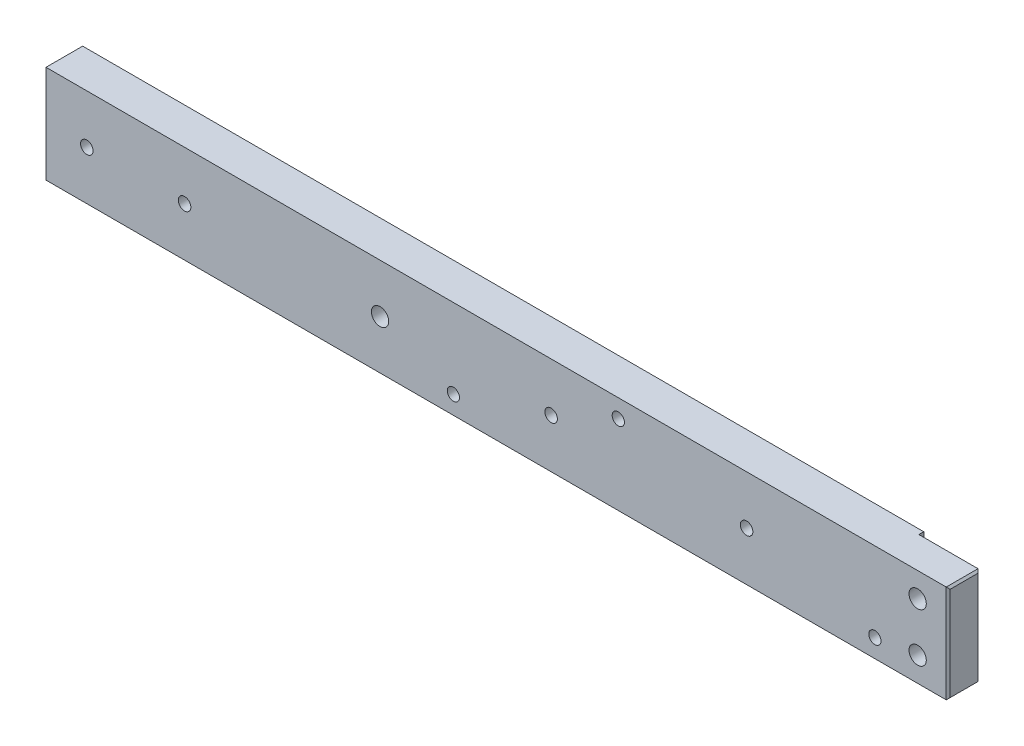
ISO-10303-21;
HEADER;
FILE_DESCRIPTION(('STEP AP214'),'2;1');
FILE_NAME('part.step','',(''),(''),'','','');
FILE_SCHEMA(('AUTOMOTIVE_DESIGN { 1 0 10303 214 1 1 1 1 }'));
ENDSEC;
DATA;
#1=APPLICATION_CONTEXT('core data for automotive mechanical design processes');
#2=APPLICATION_PROTOCOL_DEFINITION('international standard','automotive_design',2000,#1);
#3=PRODUCT_CONTEXT('',#1,'mechanical');
#4=PRODUCT('Part','Part','',(#3));
#5=PRODUCT_RELATED_PRODUCT_CATEGORY('part','',(#4));
#6=PRODUCT_DEFINITION_FORMATION('','',#4);
#7=PRODUCT_DEFINITION_CONTEXT('part definition',#1,'design');
#8=PRODUCT_DEFINITION('design','',#6,#7);
#9=PRODUCT_DEFINITION_SHAPE('','',#8);
#10=(LENGTH_UNIT() NAMED_UNIT(*) SI_UNIT(.MILLI.,.METRE.));
#11=(NAMED_UNIT(*) PLANE_ANGLE_UNIT() SI_UNIT($,.RADIAN.));
#12=(NAMED_UNIT(*) SI_UNIT($,.STERADIAN.) SOLID_ANGLE_UNIT());
#13=UNCERTAINTY_MEASURE_WITH_UNIT(LENGTH_MEASURE(1.E-05),#10,'distance_accuracy_value','');
#14=(GEOMETRIC_REPRESENTATION_CONTEXT(3) GLOBAL_UNCERTAINTY_ASSIGNED_CONTEXT((#13)) GLOBAL_UNIT_ASSIGNED_CONTEXT((#10,
#11,#12)) REPRESENTATION_CONTEXT('',''));
#15=CARTESIAN_POINT('',(0.,0.,0.));
#16=DIRECTION('',(0.,0.,1.));
#17=DIRECTION('',(1.,0.,0.));
#18=AXIS2_PLACEMENT_3D('',#15,#16,#17);
#19=CARTESIAN_POINT('',(0.,0.,9.525));
#20=DIRECTION('',(-1.,0.,0.));
#21=DIRECTION('',(0.,0.,1.));
#22=AXIS2_PLACEMENT_3D('',#19,#20,#21);
#23=PLANE('',#22);
#24=DIRECTION('',(0.,0.,1.));
#25=VECTOR('',#24,1.);
#26=CARTESIAN_POINT('',(0.,24.892,9.525));
#27=LINE('',#26,#25);
#28=CARTESIAN_POINT('',(0.,24.892,1.77800000000001));
#29=VERTEX_POINT('',#28);
#30=CARTESIAN_POINT('',(0.,24.892,9.01699999999999));
#31=VERTEX_POINT('',#30);
#32=EDGE_CURVE('E55',#29,#31,#27,.T.);
#33=ORIENTED_EDGE('',*,*,#32,.T.);
#34=DIRECTION('',(0.,-1.,0.));
#35=VECTOR('',#34,1.);
#36=CARTESIAN_POINT('',(0.,0.,9.01699999999999));
#37=LINE('',#36,#35);
#38=CARTESIAN_POINT('',(0.,0.508000000000008,9.01699999999999));
#39=VERTEX_POINT('',#38);
#40=EDGE_CURVE('E47',#31,#39,#37,.T.);
#41=ORIENTED_EDGE('',*,*,#40,.T.);
#42=DIRECTION('',(0.,0.,-1.));
#43=VECTOR('',#42,1.);
#44=CARTESIAN_POINT('',(0.,0.508000000000008,9.525));
#45=LINE('',#44,#43);
#46=CARTESIAN_POINT('',(0.,0.508000000000008,1.77800000000001));
#47=VERTEX_POINT('',#46);
#48=EDGE_CURVE('E239',#39,#47,#45,.T.);
#49=ORIENTED_EDGE('',*,*,#48,.T.);
#50=DIRECTION('',(0.,1.,0.));
#51=VECTOR('',#50,1.);
#52=CARTESIAN_POINT('',(0.,0.,1.77800000000001));
#53=LINE('',#52,#51);
#54=EDGE_CURVE('E60',#47,#29,#53,.T.);
#55=ORIENTED_EDGE('',*,*,#54,.T.);
#56=EDGE_LOOP('',(#33,#41,#49,#55));
#57=FACE_BOUND('',#56,.T.);
#58=ADVANCED_FACE('F37',(#57),#23,.F.);
#59=CARTESIAN_POINT('',(0.,25.4,9.525));
#60=DIRECTION('',(0.,-1.,0.));
#61=DIRECTION('',(1.,0.,0.));
#62=AXIS2_PLACEMENT_3D('',#59,#60,#61);
#63=PLANE('',#62);
#64=DIRECTION('',(-1.,0.,0.));
#65=VECTOR('',#64,1.);
#66=CARTESIAN_POINT('',(0.,25.4,0.));
#67=LINE('',#66,#65);
#68=CARTESIAN_POINT('',(-15.875,25.4,0.));
#69=VERTEX_POINT('',#68);
#70=CARTESIAN_POINT('',(-234.442,25.4,0.));
#71=VERTEX_POINT('',#70);
#72=EDGE_CURVE('E202',#69,#71,#67,.T.);
#73=ORIENTED_EDGE('',*,*,#72,.T.);
#74=DIRECTION('',(0.,0.,1.));
#75=VECTOR('',#74,1.);
#76=CARTESIAN_POINT('',(-234.442,25.4,9.525));
#77=LINE('',#76,#75);
#78=CARTESIAN_POINT('',(-234.442,25.4,9.525));
#79=VERTEX_POINT('',#78);
#80=EDGE_CURVE('E225',#71,#79,#77,.T.);
#81=ORIENTED_EDGE('',*,*,#80,.T.);
#82=DIRECTION('',(-1.,0.,0.));
#83=VECTOR('',#82,1.);
#84=CARTESIAN_POINT('',(0.,25.4,9.525));
#85=LINE('',#84,#83);
#86=CARTESIAN_POINT('',(-0.508000000000008,25.4,9.525));
#87=VERTEX_POINT('',#86);
#88=EDGE_CURVE('E203',#87,#79,#85,.T.);
#89=ORIENTED_EDGE('',*,*,#88,.F.);
#90=DIRECTION('',(0.,0.,-1.));
#91=VECTOR('',#90,1.);
#92=CARTESIAN_POINT('',(-0.508000000000008,25.4,9.525));
#93=LINE('',#92,#91);
#94=CARTESIAN_POINT('',(-0.508000000000008,25.4,1.27));
#95=VERTEX_POINT('',#94);
#96=EDGE_CURVE('E223',#87,#95,#93,.T.);
#97=ORIENTED_EDGE('',*,*,#96,.T.);
#98=DIRECTION('',(1.,0.,0.));
#99=VECTOR('',#98,1.);
#100=CARTESIAN_POINT('',(0.,25.4,1.27));
#101=LINE('',#100,#99);
#102=CARTESIAN_POINT('',(-15.875,25.4,1.27));
#103=VERTEX_POINT('',#102);
#104=EDGE_CURVE('E136',#103,#95,#101,.T.);
#105=ORIENTED_EDGE('',*,*,#104,.F.);
#106=DIRECTION('',(0.,0.,-1.));
#107=VECTOR('',#106,1.);
#108=CARTESIAN_POINT('',(-15.875,25.4,1.27));
#109=LINE('',#108,#107);
#110=EDGE_CURVE('E135',#103,#69,#109,.T.);
#111=ORIENTED_EDGE('',*,*,#110,.T.);
#112=EDGE_LOOP('',(#73,#81,#89,#97,#105,#111));
#113=FACE_BOUND('',#112,.T.);
#114=ADVANCED_FACE('F275',(#113),#63,.F.);
#115=CARTESIAN_POINT('',(-234.95,0.,9.525));
#116=DIRECTION('',(1.,0.,0.));
#117=DIRECTION('',(0.,0.,-1.));
#118=AXIS2_PLACEMENT_3D('',#115,#116,#117);
#119=PLANE('',#118);
#120=DIRECTION('',(0.,1.,0.));
#121=VECTOR('',#120,1.);
#122=CARTESIAN_POINT('',(-234.95,25.4,9.01699999999999));
#123=LINE('',#122,#121);
#124=CARTESIAN_POINT('',(-234.95,0.507999999999979,9.01699999999999));
#125=VERTEX_POINT('',#124);
#126=CARTESIAN_POINT('',(-234.95,24.892,9.01699999999999));
#127=VERTEX_POINT('',#126);
#128=EDGE_CURVE('E218',#125,#127,#123,.T.);
#129=ORIENTED_EDGE('',*,*,#128,.T.);
#130=DIRECTION('',(0.,0.,-1.));
#131=VECTOR('',#130,1.);
#132=CARTESIAN_POINT('',(-234.95,24.892,9.525));
#133=LINE('',#132,#131);
#134=CARTESIAN_POINT('',(-234.95,24.892,0.508000000000008));
#135=VERTEX_POINT('',#134);
#136=EDGE_CURVE('E220',#127,#135,#133,.T.);
#137=ORIENTED_EDGE('',*,*,#136,.T.);
#138=DIRECTION('',(0.,-1.,0.));
#139=VECTOR('',#138,1.);
#140=CARTESIAN_POINT('',(-234.95,0.,0.508000000000008));
#141=LINE('',#140,#139);
#142=CARTESIAN_POINT('',(-234.95,0.507999999999979,0.508000000000008));
#143=VERTEX_POINT('',#142);
#144=EDGE_CURVE('E209',#135,#143,#141,.T.);
#145=ORIENTED_EDGE('',*,*,#144,.T.);
#146=DIRECTION('',(0.,0.,1.));
#147=VECTOR('',#146,1.);
#148=CARTESIAN_POINT('',(-234.95,0.507999999999979,9.525));
#149=LINE('',#148,#147);
#150=EDGE_CURVE('E216',#143,#125,#149,.T.);
#151=ORIENTED_EDGE('',*,*,#150,.T.);
#152=EDGE_LOOP('',(#129,#137,#145,#151));
#153=FACE_BOUND('',#152,.T.);
#154=ADVANCED_FACE('F280',(#153),#119,.F.);
#155=CARTESIAN_POINT('',(0.,0.,9.525));
#156=DIRECTION('',(0.,1.,0.));
#157=DIRECTION('',(-1.,0.,0.));
#158=AXIS2_PLACEMENT_3D('',#155,#156,#157);
#159=PLANE('',#158);
#160=DIRECTION('',(1.,0.,0.));
#161=VECTOR('',#160,1.);
#162=CARTESIAN_POINT('',(0.,0.,9.525));
#163=LINE('',#162,#161);
#164=CARTESIAN_POINT('',(-234.442,0.,9.525));
#165=VERTEX_POINT('',#164);
#166=CARTESIAN_POINT('',(-0.508000000000008,0.,9.525));
#167=VERTEX_POINT('',#166);
#168=EDGE_CURVE('E206',#165,#167,#163,.T.);
#169=ORIENTED_EDGE('',*,*,#168,.F.);
#170=DIRECTION('',(0.,0.,-1.));
#171=VECTOR('',#170,1.);
#172=CARTESIAN_POINT('',(-234.442,0.,9.525));
#173=LINE('',#172,#171);
#174=CARTESIAN_POINT('',(-234.442,0.,0.));
#175=VERTEX_POINT('',#174);
#176=EDGE_CURVE('E235',#165,#175,#173,.T.);
#177=ORIENTED_EDGE('',*,*,#176,.T.);
#178=DIRECTION('',(1.,0.,0.));
#179=VECTOR('',#178,1.);
#180=CARTESIAN_POINT('',(0.,0.,0.));
#181=LINE('',#180,#179);
#182=CARTESIAN_POINT('',(-15.875,0.,0.));
#183=VERTEX_POINT('',#182);
#184=EDGE_CURVE('E141',#175,#183,#181,.T.);
#185=ORIENTED_EDGE('',*,*,#184,.T.);
#186=DIRECTION('',(0.,0.,-1.));
#187=VECTOR('',#186,1.);
#188=CARTESIAN_POINT('',(-15.875,0.,1.27));
#189=LINE('',#188,#187);
#190=CARTESIAN_POINT('',(-15.875,0.,1.27));
#191=VERTEX_POINT('',#190);
#192=EDGE_CURVE('E132',#191,#183,#189,.T.);
#193=ORIENTED_EDGE('',*,*,#192,.F.);
#194=DIRECTION('',(-1.,0.,0.));
#195=VECTOR('',#194,1.);
#196=CARTESIAN_POINT('',(0.,0.,1.27));
#197=LINE('',#196,#195);
#198=CARTESIAN_POINT('',(-0.508000000000008,0.,1.27));
#199=VERTEX_POINT('',#198);
#200=EDGE_CURVE('E116',#199,#191,#197,.T.);
#201=ORIENTED_EDGE('',*,*,#200,.F.);
#202=DIRECTION('',(0.,0.,1.));
#203=VECTOR('',#202,1.);
#204=CARTESIAN_POINT('',(-0.508000000000008,0.,9.525));
#205=LINE('',#204,#203);
#206=EDGE_CURVE('E233',#199,#167,#205,.T.);
#207=ORIENTED_EDGE('',*,*,#206,.T.);
#208=EDGE_LOOP('',(#169,#177,#185,#193,#201,#207));
#209=FACE_BOUND('',#208,.T.);
#210=ADVANCED_FACE('F139',(#209),#159,.F.);
#211=CARTESIAN_POINT('',(0.,0.,9.525));
#212=DIRECTION('',(0.,0.,1.));
#213=DIRECTION('',(1.,0.,0.));
#214=AXIS2_PLACEMENT_3D('',#211,#212,#213);
#215=PLANE('',#214);
#216=CARTESIAN_POINT('',(-19.05,4.76249999999997,9.525));
#217=DIRECTION('',(0.,0.,1.));
#218=DIRECTION('',(1.,0.,0.));
#219=AXIS2_PLACEMENT_3D('',#216,#217,#218);
#220=CIRCLE('',#219,1.5875);
#221=CARTESIAN_POINT('',(-17.4625,4.76249999999997,9.525));
#222=VERTEX_POINT('',#221);
#223=EDGE_CURVE('E150',#222,#222,#220,.T.);
#224=ORIENTED_EDGE('',*,*,#223,.F.);
#225=EDGE_LOOP('',(#224));
#226=FACE_BOUND('',#225,.T.);
#227=CARTESIAN_POINT('',(-85.725,20.6375,9.525));
#228=DIRECTION('',(0.,0.,1.));
#229=DIRECTION('',(1.,0.,0.));
#230=AXIS2_PLACEMENT_3D('',#227,#228,#229);
#231=CIRCLE('',#230,1.58750000000001);
#232=CARTESIAN_POINT('',(-84.1375,20.6375,9.525));
#233=VERTEX_POINT('',#232);
#234=EDGE_CURVE('E156',#233,#233,#231,.T.);
#235=ORIENTED_EDGE('',*,*,#234,.F.);
#236=EDGE_LOOP('',(#235));
#237=FACE_BOUND('',#236,.T.);
#238=CARTESIAN_POINT('',(-128.5875,4.76249999999997,9.525));
#239=DIRECTION('',(0.,0.,1.));
#240=DIRECTION('',(1.,0.,0.));
#241=AXIS2_PLACEMENT_3D('',#238,#239,#240);
#242=CIRCLE('',#241,1.58749999999999);
#243=CARTESIAN_POINT('',(-127.,4.76249999999997,9.525));
#244=VERTEX_POINT('',#243);
#245=EDGE_CURVE('E162',#244,#244,#242,.T.);
#246=ORIENTED_EDGE('',*,*,#245,.F.);
#247=EDGE_LOOP('',(#246));
#248=FACE_BOUND('',#247,.T.);
#249=CARTESIAN_POINT('',(-223.8375,12.7,9.525));
#250=DIRECTION('',(0.,0.,1.));
#251=DIRECTION('',(1.,0.,0.));
#252=AXIS2_PLACEMENT_3D('',#249,#250,#251);
#253=CIRCLE('',#252,1.63194999999999);
#254=CARTESIAN_POINT('',(-222.20555,12.7,9.525));
#255=VERTEX_POINT('',#254);
#256=EDGE_CURVE('E168',#255,#255,#253,.T.);
#257=ORIENTED_EDGE('',*,*,#256,.F.);
#258=EDGE_LOOP('',(#257));
#259=FACE_BOUND('',#258,.T.);
#260=CARTESIAN_POINT('',(-198.4375,12.7,9.525));
#261=DIRECTION('',(0.,0.,1.));
#262=DIRECTION('',(1.,0.,0.));
#263=AXIS2_PLACEMENT_3D('',#260,#261,#262);
#264=CIRCLE('',#263,1.63194999999999);
#265=CARTESIAN_POINT('',(-196.80555,12.7,9.525));
#266=VERTEX_POINT('',#265);
#267=EDGE_CURVE('E174',#266,#266,#264,.T.);
#268=ORIENTED_EDGE('',*,*,#267,.F.);
#269=EDGE_LOOP('',(#268));
#270=FACE_BOUND('',#269,.T.);
#271=CARTESIAN_POINT('',(-103.1875,12.7,9.525));
#272=DIRECTION('',(0.,0.,-1.));
#273=DIRECTION('',(-1.,0.,0.));
#274=AXIS2_PLACEMENT_3D('',#271,#272,#273);
#275=CIRCLE('',#274,1.63194999999999);
#276=CARTESIAN_POINT('',(-104.81945,12.7,9.525));
#277=VERTEX_POINT('',#276);
#278=EDGE_CURVE('E183',#277,#277,#275,.T.);
#279=ORIENTED_EDGE('',*,*,#278,.T.);
#280=EDGE_LOOP('',(#279));
#281=FACE_BOUND('',#280,.T.);
#282=CARTESIAN_POINT('',(-52.3875,12.7,9.525));
#283=DIRECTION('',(0.,0.,-1.));
#284=DIRECTION('',(-1.,0.,0.));
#285=AXIS2_PLACEMENT_3D('',#282,#283,#284);
#286=CIRCLE('',#285,1.63195);
#287=CARTESIAN_POINT('',(-54.01945,12.7,9.525));
#288=VERTEX_POINT('',#287);
#289=EDGE_CURVE('E189',#288,#288,#286,.T.);
#290=ORIENTED_EDGE('',*,*,#289,.T.);
#291=EDGE_LOOP('',(#290));
#292=FACE_BOUND('',#291,.T.);
#293=CARTESIAN_POINT('',(-147.6375,12.7,9.525));
#294=DIRECTION('',(0.,0.,1.));
#295=DIRECTION('',(1.,0.,0.));
#296=AXIS2_PLACEMENT_3D('',#293,#294,#295);
#297=CIRCLE('',#296,2.2479);
#298=CARTESIAN_POINT('',(-145.3896,12.7,9.525));
#299=VERTEX_POINT('',#298);
#300=EDGE_CURVE('E192',#299,#299,#297,.T.);
#301=ORIENTED_EDGE('',*,*,#300,.F.);
#302=EDGE_LOOP('',(#301));
#303=FACE_BOUND('',#302,.T.);
#304=CARTESIAN_POINT('',(-7.9375,6.34999999999999,9.525));
#305=DIRECTION('',(0.,0.,1.));
#306=DIRECTION('',(1.,0.,0.));
#307=AXIS2_PLACEMENT_3D('',#304,#305,#306);
#308=CIRCLE('',#307,2.24789999999999);
#309=CARTESIAN_POINT('',(-5.68960000000001,6.34999999999999,9.525));
#310=VERTEX_POINT('',#309);
#311=EDGE_CURVE('E196',#310,#310,#308,.T.);
#312=ORIENTED_EDGE('',*,*,#311,.F.);
#313=EDGE_LOOP('',(#312));
#314=FACE_BOUND('',#313,.T.);
#315=CARTESIAN_POINT('',(-7.9375,19.05,9.525));
#316=DIRECTION('',(0.,0.,1.));
#317=DIRECTION('',(1.,0.,0.));
#318=AXIS2_PLACEMENT_3D('',#315,#316,#317);
#319=CIRCLE('',#318,2.24789999999999);
#320=CARTESIAN_POINT('',(-5.68960000000001,19.05,9.525));
#321=VERTEX_POINT('',#320);
#322=EDGE_CURVE('E199',#321,#321,#319,.T.);
#323=ORIENTED_EDGE('',*,*,#322,.F.);
#324=EDGE_LOOP('',(#323));
#325=FACE_BOUND('',#324,.T.);
#326=ORIENTED_EDGE('',*,*,#88,.T.);
#327=DIRECTION('',(0.,-1.,0.));
#328=VECTOR('',#327,1.);
#329=CARTESIAN_POINT('',(-234.442,0.,9.525));
#330=LINE('',#329,#328);
#331=EDGE_CURVE('E231',#79,#165,#330,.T.);
#332=ORIENTED_EDGE('',*,*,#331,.T.);
#333=ORIENTED_EDGE('',*,*,#168,.T.);
#334=DIRECTION('',(0.,1.,0.));
#335=VECTOR('',#334,1.);
#336=CARTESIAN_POINT('',(-0.508000000000008,25.4,9.525));
#337=LINE('',#336,#335);
#338=EDGE_CURVE('E228',#167,#87,#337,.T.);
#339=ORIENTED_EDGE('',*,*,#338,.T.);
#340=EDGE_LOOP('',(#326,#332,#333,#339));
#341=FACE_BOUND('',#340,.T.);
#342=ADVANCED_FACE('F446',(#226,#237,#248,#259,#270,#281,#292,#303,#314,#325,#341),#215,.T.);
#343=CARTESIAN_POINT('',(0.,0.,0.));
#344=DIRECTION('',(0.,0.,1.));
#345=DIRECTION('',(1.,0.,0.));
#346=AXIS2_PLACEMENT_3D('',#343,#344,#345);
#347=PLANE('',#346);
#348=CARTESIAN_POINT('',(-19.05,4.76249999999997,0.));
#349=DIRECTION('',(0.,0.,1.));
#350=DIRECTION('',(1.,0.,0.));
#351=AXIS2_PLACEMENT_3D('',#348,#349,#350);
#352=CIRCLE('',#351,1.5875);
#353=CARTESIAN_POINT('',(-17.4625,4.76249999999997,0.));
#354=VERTEX_POINT('',#353);
#355=EDGE_CURVE('E153',#354,#354,#352,.T.);
#356=ORIENTED_EDGE('',*,*,#355,.T.);
#357=EDGE_LOOP('',(#356));
#358=FACE_BOUND('',#357,.T.);
#359=CARTESIAN_POINT('',(-85.725,20.6375,0.));
#360=DIRECTION('',(0.,0.,1.));
#361=DIRECTION('',(1.,0.,0.));
#362=AXIS2_PLACEMENT_3D('',#359,#360,#361);
#363=CIRCLE('',#362,1.5875);
#364=CARTESIAN_POINT('',(-84.1375,20.6375,0.));
#365=VERTEX_POINT('',#364);
#366=EDGE_CURVE('E159',#365,#365,#363,.T.);
#367=ORIENTED_EDGE('',*,*,#366,.T.);
#368=EDGE_LOOP('',(#367));
#369=FACE_BOUND('',#368,.T.);
#370=CARTESIAN_POINT('',(-128.5875,4.76249999999997,0.));
#371=DIRECTION('',(0.,0.,1.));
#372=DIRECTION('',(1.,0.,0.));
#373=AXIS2_PLACEMENT_3D('',#370,#371,#372);
#374=CIRCLE('',#373,1.58749999999999);
#375=CARTESIAN_POINT('',(-127.,4.76249999999997,0.));
#376=VERTEX_POINT('',#375);
#377=EDGE_CURVE('E165',#376,#376,#374,.T.);
#378=ORIENTED_EDGE('',*,*,#377,.T.);
#379=EDGE_LOOP('',(#378));
#380=FACE_BOUND('',#379,.T.);
#381=CARTESIAN_POINT('',(-223.8375,12.7,0.));
#382=DIRECTION('',(0.,0.,1.));
#383=DIRECTION('',(1.,0.,0.));
#384=AXIS2_PLACEMENT_3D('',#381,#382,#383);
#385=CIRCLE('',#384,1.63194999999999);
#386=CARTESIAN_POINT('',(-222.20555,12.7,0.));
#387=VERTEX_POINT('',#386);
#388=EDGE_CURVE('E171',#387,#387,#385,.T.);
#389=ORIENTED_EDGE('',*,*,#388,.T.);
#390=EDGE_LOOP('',(#389));
#391=FACE_BOUND('',#390,.T.);
#392=CARTESIAN_POINT('',(-198.4375,12.7,0.));
#393=DIRECTION('',(0.,0.,1.));
#394=DIRECTION('',(1.,0.,0.));
#395=AXIS2_PLACEMENT_3D('',#392,#393,#394);
#396=CIRCLE('',#395,1.63194999999999);
#397=CARTESIAN_POINT('',(-196.80555,12.7,0.));
#398=VERTEX_POINT('',#397);
#399=EDGE_CURVE('E177',#398,#398,#396,.T.);
#400=ORIENTED_EDGE('',*,*,#399,.T.);
#401=EDGE_LOOP('',(#400));
#402=FACE_BOUND('',#401,.T.);
#403=CARTESIAN_POINT('',(-103.1875,12.7,0.));
#404=DIRECTION('',(0.,0.,-1.));
#405=DIRECTION('',(-1.,0.,0.));
#406=AXIS2_PLACEMENT_3D('',#403,#404,#405);
#407=CIRCLE('',#406,1.63194999999999);
#408=CARTESIAN_POINT('',(-104.81945,12.7,0.));
#409=VERTEX_POINT('',#408);
#410=EDGE_CURVE('E180',#409,#409,#407,.T.);
#411=ORIENTED_EDGE('',*,*,#410,.F.);
#412=EDGE_LOOP('',(#411));
#413=FACE_BOUND('',#412,.T.);
#414=CARTESIAN_POINT('',(-52.3875,12.7,0.));
#415=DIRECTION('',(0.,0.,-1.));
#416=DIRECTION('',(-1.,0.,0.));
#417=AXIS2_PLACEMENT_3D('',#414,#415,#416);
#418=CIRCLE('',#417,1.63195);
#419=CARTESIAN_POINT('',(-54.01945,12.7,0.));
#420=VERTEX_POINT('',#419);
#421=EDGE_CURVE('E186',#420,#420,#418,.T.);
#422=ORIENTED_EDGE('',*,*,#421,.F.);
#423=EDGE_LOOP('',(#422));
#424=FACE_BOUND('',#423,.T.);
#425=CARTESIAN_POINT('',(-147.6375,12.7,0.));
#426=DIRECTION('',(0.,0.,1.));
#427=DIRECTION('',(1.,0.,0.));
#428=AXIS2_PLACEMENT_3D('',#425,#426,#427);
#429=CIRCLE('',#428,2.2479);
#430=CARTESIAN_POINT('',(-145.3896,12.7,0.));
#431=VERTEX_POINT('',#430);
#432=EDGE_CURVE('E195',#431,#431,#429,.T.);
#433=ORIENTED_EDGE('',*,*,#432,.T.);
#434=EDGE_LOOP('',(#433));
#435=FACE_BOUND('',#434,.T.);
#436=ORIENTED_EDGE('',*,*,#184,.F.);
#437=DIRECTION('',(0.,1.,0.));
#438=VECTOR('',#437,1.);
#439=CARTESIAN_POINT('',(-234.442,0.,0.));
#440=LINE('',#439,#438);
#441=EDGE_CURVE('E237',#175,#71,#440,.T.);
#442=ORIENTED_EDGE('',*,*,#441,.T.);
#443=ORIENTED_EDGE('',*,*,#72,.F.);
#444=DIRECTION('',(0.,1.,0.));
#445=VECTOR('',#444,1.);
#446=CARTESIAN_POINT('',(-15.875,0.,0.));
#447=LINE('',#446,#445);
#448=EDGE_CURVE('E127',#183,#69,#447,.T.);
#449=ORIENTED_EDGE('',*,*,#448,.F.);
#450=EDGE_LOOP('',(#436,#442,#443,#449));
#451=FACE_BOUND('',#450,.T.);
#452=ADVANCED_FACE('F439',(#358,#369,#380,#391,#402,#413,#424,#435,#451),#347,.F.);
#453=CARTESIAN_POINT('',(-7.9375,19.05,9.525));
#454=DIRECTION('',(0.,0.,1.));
#455=DIRECTION('',(1.,0.,0.));
#456=AXIS2_PLACEMENT_3D('',#453,#454,#455);
#457=CYLINDRICAL_SURFACE('',#456,2.24789999999999);
#458=CARTESIAN_POINT('',(-7.9375,19.05,1.27));
#459=DIRECTION('',(0.,0.,1.));
#460=DIRECTION('',(1.,0.,0.));
#461=AXIS2_PLACEMENT_3D('',#458,#459,#460);
#462=CIRCLE('',#461,2.24789999999999);
#463=CARTESIAN_POINT('',(-5.68960000000001,19.05,1.27));
#464=VERTEX_POINT('',#463);
#465=EDGE_CURVE('E143',#464,#464,#462,.F.);
#466=ORIENTED_EDGE('',*,*,#465,.T.);
#467=EDGE_LOOP('',(#466));
#468=FACE_BOUND('',#467,.T.);
#469=ORIENTED_EDGE('',*,*,#322,.T.);
#470=EDGE_LOOP('',(#469));
#471=FACE_BOUND('',#470,.T.);
#472=ADVANCED_FACE('F432',(#468,#471),#457,.F.);
#473=CARTESIAN_POINT('',(-7.9375,6.34999999999999,9.525));
#474=DIRECTION('',(0.,0.,1.));
#475=DIRECTION('',(1.,0.,0.));
#476=AXIS2_PLACEMENT_3D('',#473,#474,#475);
#477=CYLINDRICAL_SURFACE('',#476,2.24789999999999);
#478=CARTESIAN_POINT('',(-7.9375,6.34999999999999,1.27));
#479=DIRECTION('',(0.,0.,-1.));
#480=DIRECTION('',(-1.,0.,0.));
#481=AXIS2_PLACEMENT_3D('',#478,#479,#480);
#482=CIRCLE('',#481,2.24789999999999);
#483=CARTESIAN_POINT('',(-10.1854,6.34999999999999,1.27));
#484=VERTEX_POINT('',#483);
#485=EDGE_CURVE('E254',#484,#484,#482,.T.);
#486=ORIENTED_EDGE('',*,*,#485,.T.);
#487=EDGE_LOOP('',(#486));
#488=FACE_BOUND('',#487,.T.);
#489=ORIENTED_EDGE('',*,*,#311,.T.);
#490=EDGE_LOOP('',(#489));
#491=FACE_BOUND('',#490,.T.);
#492=ADVANCED_FACE('F425',(#488,#491),#477,.F.);
#493=CARTESIAN_POINT('',(-147.6375,12.7,9.525));
#494=DIRECTION('',(0.,0.,1.));
#495=DIRECTION('',(1.,0.,0.));
#496=AXIS2_PLACEMENT_3D('',#493,#494,#495);
#497=CYLINDRICAL_SURFACE('',#496,2.2479);
#498=ORIENTED_EDGE('',*,*,#300,.T.);
#499=EDGE_LOOP('',(#498));
#500=FACE_BOUND('',#499,.T.);
#501=ORIENTED_EDGE('',*,*,#432,.F.);
#502=EDGE_LOOP('',(#501));
#503=FACE_BOUND('',#502,.T.);
#504=ADVANCED_FACE('F417',(#500,#503),#497,.F.);
#505=CARTESIAN_POINT('',(-52.3875,12.7,0.));
#506=DIRECTION('',(0.,0.,-1.));
#507=DIRECTION('',(-1.,0.,0.));
#508=AXIS2_PLACEMENT_3D('',#505,#506,#507);
#509=CYLINDRICAL_SURFACE('',#508,1.63195);
#510=ORIENTED_EDGE('',*,*,#289,.F.);
#511=EDGE_LOOP('',(#510));
#512=FACE_BOUND('',#511,.T.);
#513=ORIENTED_EDGE('',*,*,#421,.T.);
#514=EDGE_LOOP('',(#513));
#515=FACE_BOUND('',#514,.T.);
#516=ADVANCED_FACE('F409',(#512,#515),#509,.F.);
#517=CARTESIAN_POINT('',(-103.1875,12.7,0.));
#518=DIRECTION('',(0.,0.,-1.));
#519=DIRECTION('',(-1.,0.,0.));
#520=AXIS2_PLACEMENT_3D('',#517,#518,#519);
#521=CYLINDRICAL_SURFACE('',#520,1.63194999999999);
#522=ORIENTED_EDGE('',*,*,#278,.F.);
#523=EDGE_LOOP('',(#522));
#524=FACE_BOUND('',#523,.T.);
#525=ORIENTED_EDGE('',*,*,#410,.T.);
#526=EDGE_LOOP('',(#525));
#527=FACE_BOUND('',#526,.T.);
#528=ADVANCED_FACE('F401',(#524,#527),#521,.F.);
#529=CARTESIAN_POINT('',(-198.4375,12.7,9.525));
#530=DIRECTION('',(0.,0.,1.));
#531=DIRECTION('',(1.,0.,0.));
#532=AXIS2_PLACEMENT_3D('',#529,#530,#531);
#533=CYLINDRICAL_SURFACE('',#532,1.63194999999999);
#534=ORIENTED_EDGE('',*,*,#399,.F.);
#535=EDGE_LOOP('',(#534));
#536=FACE_BOUND('',#535,.T.);
#537=ORIENTED_EDGE('',*,*,#267,.T.);
#538=EDGE_LOOP('',(#537));
#539=FACE_BOUND('',#538,.T.);
#540=ADVANCED_FACE('F393',(#536,#539),#533,.F.);
#541=CARTESIAN_POINT('',(-223.8375,12.7,9.525));
#542=DIRECTION('',(0.,0.,1.));
#543=DIRECTION('',(1.,0.,0.));
#544=AXIS2_PLACEMENT_3D('',#541,#542,#543);
#545=CYLINDRICAL_SURFACE('',#544,1.63194999999999);
#546=ORIENTED_EDGE('',*,*,#388,.F.);
#547=EDGE_LOOP('',(#546));
#548=FACE_BOUND('',#547,.T.);
#549=ORIENTED_EDGE('',*,*,#256,.T.);
#550=EDGE_LOOP('',(#549));
#551=FACE_BOUND('',#550,.T.);
#552=ADVANCED_FACE('F385',(#548,#551),#545,.F.);
#553=CARTESIAN_POINT('',(-128.5875,4.76249999999997,9.525));
#554=DIRECTION('',(0.,0.,1.));
#555=DIRECTION('',(1.,0.,0.));
#556=AXIS2_PLACEMENT_3D('',#553,#554,#555);
#557=CYLINDRICAL_SURFACE('',#556,1.58749999999999);
#558=ORIENTED_EDGE('',*,*,#377,.F.);
#559=EDGE_LOOP('',(#558));
#560=FACE_BOUND('',#559,.T.);
#561=ORIENTED_EDGE('',*,*,#245,.T.);
#562=EDGE_LOOP('',(#561));
#563=FACE_BOUND('',#562,.T.);
#564=ADVANCED_FACE('F377',(#560,#563),#557,.F.);
#565=CARTESIAN_POINT('',(-85.725,20.6375,9.525));
#566=DIRECTION('',(0.,0.,1.));
#567=DIRECTION('',(1.,0.,0.));
#568=AXIS2_PLACEMENT_3D('',#565,#566,#567);
#569=CYLINDRICAL_SURFACE('',#568,1.5875);
#570=ORIENTED_EDGE('',*,*,#366,.F.);
#571=EDGE_LOOP('',(#570));
#572=FACE_BOUND('',#571,.T.);
#573=ORIENTED_EDGE('',*,*,#234,.T.);
#574=EDGE_LOOP('',(#573));
#575=FACE_BOUND('',#574,.T.);
#576=ADVANCED_FACE('F368',(#572,#575),#569,.F.);
#577=CARTESIAN_POINT('',(-19.05,4.76249999999997,9.525));
#578=DIRECTION('',(0.,0.,1.));
#579=DIRECTION('',(1.,0.,0.));
#580=AXIS2_PLACEMENT_3D('',#577,#578,#579);
#581=CYLINDRICAL_SURFACE('',#580,1.5875);
#582=ORIENTED_EDGE('',*,*,#355,.F.);
#583=EDGE_LOOP('',(#582));
#584=FACE_BOUND('',#583,.T.);
#585=ORIENTED_EDGE('',*,*,#223,.T.);
#586=EDGE_LOOP('',(#585));
#587=FACE_BOUND('',#586,.T.);
#588=ADVANCED_FACE('F360',(#584,#587),#581,.F.);
#589=CARTESIAN_POINT('',(0.,0.,1.27));
#590=DIRECTION('',(0.,0.,1.));
#591=DIRECTION('',(1.,0.,0.));
#592=AXIS2_PLACEMENT_3D('',#589,#590,#591);
#593=PLANE('',#592);
#594=ORIENTED_EDGE('',*,*,#104,.T.);
#595=DIRECTION('',(0.,-1.,0.));
#596=VECTOR('',#595,1.);
#597=CARTESIAN_POINT('',(-0.508000000000008,0.,1.27));
#598=LINE('',#597,#596);
#599=EDGE_CURVE('E11',#95,#199,#598,.T.);
#600=ORIENTED_EDGE('',*,*,#599,.T.);
#601=ORIENTED_EDGE('',*,*,#200,.T.);
#602=DIRECTION('',(0.,1.,0.));
#603=VECTOR('',#602,1.);
#604=CARTESIAN_POINT('',(-15.875,0.,1.27));
#605=LINE('',#604,#603);
#606=EDGE_CURVE('E121',#191,#103,#605,.T.);
#607=ORIENTED_EDGE('',*,*,#606,.T.);
#608=EDGE_LOOP('',(#594,#600,#601,#607));
#609=FACE_BOUND('',#608,.T.);
#610=ORIENTED_EDGE('',*,*,#485,.F.);
#611=EDGE_LOOP('',(#610));
#612=FACE_BOUND('',#611,.T.);
#613=ORIENTED_EDGE('',*,*,#465,.F.);
#614=EDGE_LOOP('',(#613));
#615=FACE_BOUND('',#614,.T.);
#616=ADVANCED_FACE('F119',(#609,#612,#615),#593,.F.);
#617=CARTESIAN_POINT('',(-15.875,0.,1.27));
#618=DIRECTION('',(-1.,0.,0.));
#619=DIRECTION('',(0.,0.,1.));
#620=AXIS2_PLACEMENT_3D('',#617,#618,#619);
#621=PLANE('',#620);
#622=ORIENTED_EDGE('',*,*,#448,.T.);
#623=ORIENTED_EDGE('',*,*,#110,.F.);
#624=ORIENTED_EDGE('',*,*,#606,.F.);
#625=ORIENTED_EDGE('',*,*,#192,.T.);
#626=EDGE_LOOP('',(#622,#623,#624,#625));
#627=FACE_BOUND('',#626,.T.);
#628=ADVANCED_FACE('F131',(#627),#621,.F.);
#629=CARTESIAN_POINT('',(-234.442,0.,9.525));
#630=DIRECTION('',(0.707106781186547,0.707106781186548,0.));
#631=DIRECTION('',(0.,0.,-1.));
#632=AXIS2_PLACEMENT_3D('',#629,#630,#631);
#633=PLANE('',#632);
#634=DIRECTION('',(-0.577350269189626,0.577350269189625,0.577350269189626));
#635=VECTOR('',#634,1.);
#636=CARTESIAN_POINT('',(-234.780666666667,0.338666666666643,0.338666666666672));
#637=LINE('',#636,#635);
#638=EDGE_CURVE('E248',#175,#143,#637,.T.);
#639=ORIENTED_EDGE('',*,*,#638,.F.);
#640=ORIENTED_EDGE('',*,*,#176,.F.);
#641=DIRECTION('',(0.577350269189626,-0.577350269189625,0.577350269189626));
#642=VECTOR('',#641,1.);
#643=CARTESIAN_POINT('',(-234.442,0.,9.525));
#644=LINE('',#643,#642);
#645=EDGE_CURVE('E251',#125,#165,#644,.T.);
#646=ORIENTED_EDGE('',*,*,#645,.F.);
#647=ORIENTED_EDGE('',*,*,#150,.F.);
#648=EDGE_LOOP('',(#639,#640,#646,#647));
#649=FACE_BOUND('',#648,.T.);
#650=ADVANCED_FACE('F306',(#649),#633,.F.);
#651=CARTESIAN_POINT('',(-234.442,0.,9.525));
#652=DIRECTION('',(-0.707106781186547,0.,0.707106781186547));
#653=DIRECTION('',(0.,1.,0.));
#654=AXIS2_PLACEMENT_3D('',#651,#652,#653);
#655=PLANE('',#654);
#656=ORIENTED_EDGE('',*,*,#645,.T.);
#657=ORIENTED_EDGE('',*,*,#331,.F.);
#658=DIRECTION('',(0.577350269189626,0.577350269189626,0.577350269189626));
#659=VECTOR('',#658,1.);
#660=CARTESIAN_POINT('',(-242.908666666667,16.9333333333333,1.05833333333334));
#661=LINE('',#660,#659);
#662=EDGE_CURVE('E246',#127,#79,#661,.T.);
#663=ORIENTED_EDGE('',*,*,#662,.F.);
#664=ORIENTED_EDGE('',*,*,#128,.F.);
#665=EDGE_LOOP('',(#656,#657,#663,#664));
#666=FACE_BOUND('',#665,.T.);
#667=ADVANCED_FACE('F299',(#666),#655,.T.);
#668=CARTESIAN_POINT('',(-234.95,0.,0.508000000000008));
#669=DIRECTION('',(0.707106781186547,0.,0.707106781186547));
#670=DIRECTION('',(0.,-1.,0.));
#671=AXIS2_PLACEMENT_3D('',#668,#669,#670);
#672=PLANE('',#671);
#673=ORIENTED_EDGE('',*,*,#638,.T.);
#674=ORIENTED_EDGE('',*,*,#144,.F.);
#675=DIRECTION('',(0.577350269189626,0.577350269189626,-0.577350269189626));
#676=VECTOR('',#675,1.);
#677=CARTESIAN_POINT('',(-243.247333333333,16.5946666666666,8.80533333333334));
#678=LINE('',#677,#676);
#679=EDGE_CURVE('E244',#71,#135,#678,.F.);
#680=ORIENTED_EDGE('',*,*,#679,.F.);
#681=ORIENTED_EDGE('',*,*,#441,.F.);
#682=EDGE_LOOP('',(#673,#674,#680,#681));
#683=FACE_BOUND('',#682,.T.);
#684=ADVANCED_FACE('F292',(#683),#672,.F.);
#685=CARTESIAN_POINT('',(-234.95,24.892,9.525));
#686=DIRECTION('',(0.707106781186547,-0.707106781186547,0.));
#687=DIRECTION('',(0.,0.,-1.));
#688=AXIS2_PLACEMENT_3D('',#685,#686,#687);
#689=PLANE('',#688);
#690=ORIENTED_EDGE('',*,*,#662,.T.);
#691=ORIENTED_EDGE('',*,*,#80,.F.);
#692=ORIENTED_EDGE('',*,*,#679,.T.);
#693=ORIENTED_EDGE('',*,*,#136,.F.);
#694=EDGE_LOOP('',(#690,#691,#692,#693));
#695=FACE_BOUND('',#694,.T.);
#696=ADVANCED_FACE('F286',(#695),#689,.F.);
#697=CARTESIAN_POINT('',(-0.508000000000008,0.,1.27));
#698=DIRECTION('',(-0.707106781186548,0.,0.707106781186547));
#699=DIRECTION('',(0.,-1.,0.));
#700=AXIS2_PLACEMENT_3D('',#697,#698,#699);
#701=PLANE('',#700);
#702=DIRECTION('',(0.577350269189626,-0.577350269189626,0.577350269189626));
#703=VECTOR('',#702,1.);
#704=CARTESIAN_POINT('',(7.95866666666665,16.9333333333333,9.73666666666667));
#705=LINE('',#704,#703);
#706=EDGE_CURVE('E258',#29,#95,#705,.F.);
#707=ORIENTED_EDGE('',*,*,#706,.F.);
#708=ORIENTED_EDGE('',*,*,#54,.F.);
#709=DIRECTION('',(0.577350269189626,0.577350269189626,0.577350269189626));
#710=VECTOR('',#709,1.);
#711=CARTESIAN_POINT('',(2.58233333333333,3.09033333333334,4.36033333333334));
#712=LINE('',#711,#710);
#713=EDGE_CURVE('E42',#199,#47,#712,.T.);
#714=ORIENTED_EDGE('',*,*,#713,.F.);
#715=ORIENTED_EDGE('',*,*,#599,.F.);
#716=EDGE_LOOP('',(#707,#708,#714,#715));
#717=FACE_BOUND('',#716,.T.);
#718=ADVANCED_FACE('F40',(#717),#701,.F.);
#719=CARTESIAN_POINT('',(0.,0.508000000000008,9.525));
#720=DIRECTION('',(-0.707106781186548,0.707106781186548,0.));
#721=DIRECTION('',(0.,0.,-1.));
#722=AXIS2_PLACEMENT_3D('',#719,#720,#721);
#723=PLANE('',#722);
#724=ORIENTED_EDGE('',*,*,#713,.T.);
#725=ORIENTED_EDGE('',*,*,#48,.F.);
#726=DIRECTION('',(0.577350269189626,0.577350269189626,-0.577350269189626));
#727=VECTOR('',#726,1.);
#728=CARTESIAN_POINT('',(-0.169333333333336,0.338666666666672,9.18633333333333));
#729=LINE('',#728,#727);
#730=EDGE_CURVE('E257',#167,#39,#729,.T.);
#731=ORIENTED_EDGE('',*,*,#730,.F.);
#732=ORIENTED_EDGE('',*,*,#206,.F.);
#733=EDGE_LOOP('',(#724,#725,#731,#732));
#734=FACE_BOUND('',#733,.T.);
#735=ADVANCED_FACE('F266',(#734),#723,.F.);
#736=CARTESIAN_POINT('',(-0.508000000000008,25.4,9.525));
#737=DIRECTION('',(-0.707106781186548,-0.707106781186547,0.));
#738=DIRECTION('',(0.,0.,-1.));
#739=AXIS2_PLACEMENT_3D('',#736,#737,#738);
#740=PLANE('',#739);
#741=ORIENTED_EDGE('',*,*,#706,.T.);
#742=ORIENTED_EDGE('',*,*,#96,.F.);
#743=DIRECTION('',(-0.577350269189626,0.577350269189626,0.577350269189626));
#744=VECTOR('',#743,1.);
#745=CARTESIAN_POINT('',(-0.508000000000008,25.4,9.525));
#746=LINE('',#745,#744);
#747=EDGE_CURVE('E255',#31,#87,#746,.T.);
#748=ORIENTED_EDGE('',*,*,#747,.F.);
#749=ORIENTED_EDGE('',*,*,#32,.F.);
#750=EDGE_LOOP('',(#741,#742,#748,#749));
#751=FACE_BOUND('',#750,.T.);
#752=ADVANCED_FACE('F270',(#751),#740,.F.);
#753=CARTESIAN_POINT('',(-0.508000000000008,0.,9.525));
#754=DIRECTION('',(0.707106781186548,0.,0.707106781186547));
#755=DIRECTION('',(0.,-1.,0.));
#756=AXIS2_PLACEMENT_3D('',#753,#754,#755);
#757=PLANE('',#756);
#758=ORIENTED_EDGE('',*,*,#730,.T.);
#759=ORIENTED_EDGE('',*,*,#40,.F.);
#760=ORIENTED_EDGE('',*,*,#747,.T.);
#761=ORIENTED_EDGE('',*,*,#338,.F.);
#762=EDGE_LOOP('',(#758,#759,#760,#761));
#763=FACE_BOUND('',#762,.T.);
#764=ADVANCED_FACE('F273',(#763),#757,.T.);
#765=CLOSED_SHELL('',(#58,#114,#154,#210,#342,#452,#472,#492,#504,#516,#528,#540,#552,#564,#576,
#588,#616,#628,#650,#667,#684,#696,#718,#735,#752,#764));
#766=MANIFOLD_SOLID_BREP('B2',#765);
#767=ADVANCED_BREP_SHAPE_REPRESENTATION('',(#18,#766),#14);
#768=SHAPE_DEFINITION_REPRESENTATION(#9,#767);
ENDSEC;
END-ISO-10303-21;
